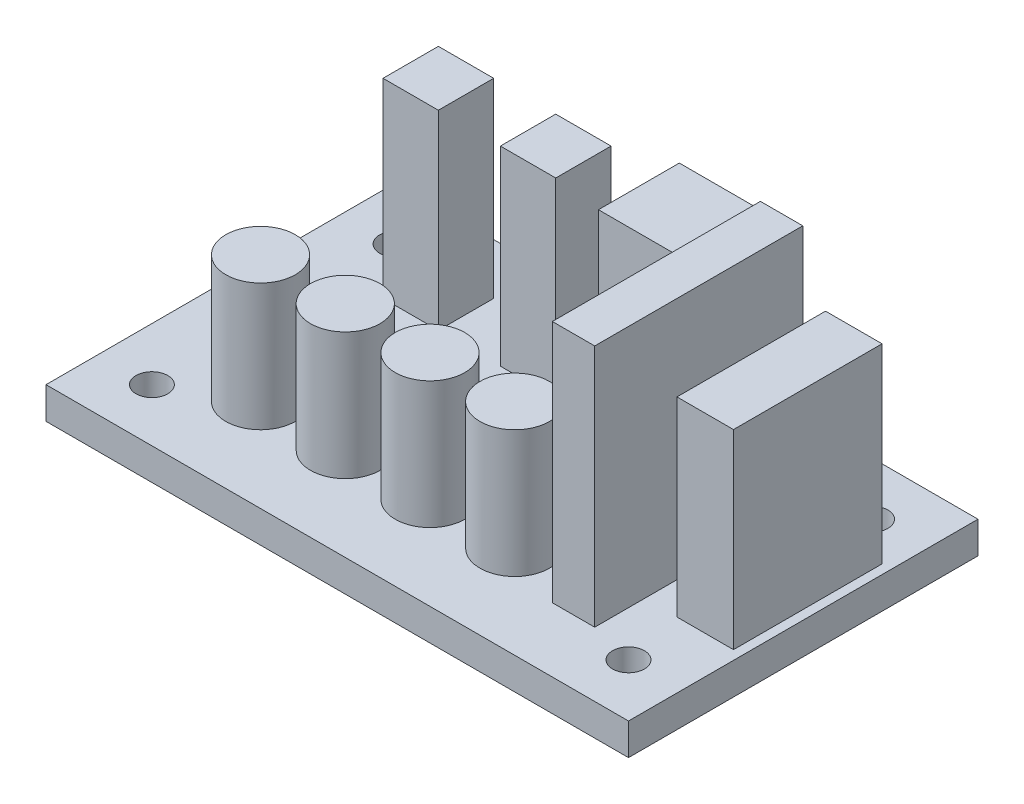
ISO-10303-21;
HEADER;
FILE_DESCRIPTION(('STEP AP214'),'2;1');
FILE_NAME('part.step','',(''),(''),'','','');
FILE_SCHEMA(('AUTOMOTIVE_DESIGN { 1 0 10303 214 1 1 1 1 }'));
ENDSEC;
DATA;
#1=APPLICATION_CONTEXT('core data for automotive mechanical design processes');
#2=APPLICATION_PROTOCOL_DEFINITION('international standard','automotive_design',2000,#1);
#3=PRODUCT_CONTEXT('',#1,'mechanical');
#4=PRODUCT('Part','Part','',(#3));
#5=PRODUCT_RELATED_PRODUCT_CATEGORY('part','',(#4));
#6=PRODUCT_DEFINITION_FORMATION('','',#4);
#7=PRODUCT_DEFINITION_CONTEXT('part definition',#1,'design');
#8=PRODUCT_DEFINITION('design','',#6,#7);
#9=PRODUCT_DEFINITION_SHAPE('','',#8);
#10=(LENGTH_UNIT() NAMED_UNIT(*) SI_UNIT(.MILLI.,.METRE.));
#11=(NAMED_UNIT(*) PLANE_ANGLE_UNIT() SI_UNIT($,.RADIAN.));
#12=(NAMED_UNIT(*) SI_UNIT($,.STERADIAN.) SOLID_ANGLE_UNIT());
#13=UNCERTAINTY_MEASURE_WITH_UNIT(LENGTH_MEASURE(1.E-05),#10,'distance_accuracy_value','');
#14=(GEOMETRIC_REPRESENTATION_CONTEXT(3) GLOBAL_UNCERTAINTY_ASSIGNED_CONTEXT((#13)) GLOBAL_UNIT_ASSIGNED_CONTEXT((#10,
#11,#12)) REPRESENTATION_CONTEXT('',''));
#15=CARTESIAN_POINT('',(0.,0.,0.));
#16=DIRECTION('',(0.,0.,1.));
#17=DIRECTION('',(1.,0.,0.));
#18=AXIS2_PLACEMENT_3D('',#15,#16,#17);
#19=CARTESIAN_POINT('',(0.,3.,-33.));
#20=DIRECTION('',(0.,-1.,0.));
#21=DIRECTION('',(0.,0.,-1.));
#22=AXIS2_PLACEMENT_3D('',#19,#20,#21);
#23=PLANE('',#22);
#24=CARTESIAN_POINT('',(35.5,3.,-8.75676326373309));
#25=DIRECTION('',(0.,-1.,0.));
#26=DIRECTION('',(0.,0.,-1.));
#27=AXIS2_PLACEMENT_3D('',#24,#25,#26);
#28=CIRCLE('',#27,3.27908034810426);
#29=CARTESIAN_POINT('',(35.5,3.,-12.0358436118374));
#30=VERTEX_POINT('',#29);
#31=EDGE_CURVE('E11',#30,#30,#28,.F.);
#32=ORIENTED_EDGE('',*,*,#31,.F.);
#33=EDGE_LOOP('',(#32));
#34=FACE_BOUND('',#33,.T.);
#35=CARTESIAN_POINT('',(19.5,3.,-8.75676326373309));
#36=DIRECTION('',(0.,-1.,0.));
#37=DIRECTION('',(0.,0.,-1.));
#38=AXIS2_PLACEMENT_3D('',#35,#36,#37);
#39=CIRCLE('',#38,3.27908034810427);
#40=CARTESIAN_POINT('',(19.5,3.,-12.0358436118374));
#41=VERTEX_POINT('',#40);
#42=EDGE_CURVE('E422',#41,#41,#39,.F.);
#43=ORIENTED_EDGE('',*,*,#42,.F.);
#44=EDGE_LOOP('',(#43));
#45=FACE_BOUND('',#44,.T.);
#46=DIRECTION('',(0.,0.,1.));
#47=VECTOR('',#46,1.);
#48=CARTESIAN_POINT('',(19.9399820026374,3.,-28.1893330684113));
#49=LINE('',#48,#47);
#50=CARTESIAN_POINT('',(19.9399820026374,3.,-28.1893330684113));
#51=VERTEX_POINT('',#50);
#52=CARTESIAN_POINT('',(19.9399820026374,3.,-22.96497794012));
#53=VERTEX_POINT('',#52);
#54=EDGE_CURVE('E232',#51,#53,#49,.T.);
#55=ORIENTED_EDGE('',*,*,#54,.F.);
#56=DIRECTION('',(-1.,0.,0.));
#57=VECTOR('',#56,1.);
#58=CARTESIAN_POINT('',(19.9399820026374,3.,-28.1893330684113));
#59=LINE('',#58,#57);
#60=CARTESIAN_POINT('',(25.1643371309287,3.,-28.1893330684113));
#61=VERTEX_POINT('',#60);
#62=EDGE_CURVE('E237',#61,#51,#59,.T.);
#63=ORIENTED_EDGE('',*,*,#62,.F.);
#64=DIRECTION('',(0.,0.,-1.));
#65=VECTOR('',#64,1.);
#66=CARTESIAN_POINT('',(25.1643371309287,3.,-28.1893330684113));
#67=LINE('',#66,#65);
#68=CARTESIAN_POINT('',(25.1643371309287,3.,-22.96497794012));
#69=VERTEX_POINT('',#68);
#70=EDGE_CURVE('E249',#69,#61,#67,.T.);
#71=ORIENTED_EDGE('',*,*,#70,.F.);
#72=DIRECTION('',(1.,0.,0.));
#73=VECTOR('',#72,1.);
#74=CARTESIAN_POINT('',(19.9399820026374,3.,-22.96497794012));
#75=LINE('',#74,#73);
#76=EDGE_CURVE('E246',#53,#69,#75,.T.);
#77=ORIENTED_EDGE('',*,*,#76,.F.);
#78=EDGE_LOOP('',(#55,#63,#71,#77));
#79=FACE_BOUND('',#78,.T.);
#80=DIRECTION('',(0.,0.,1.));
#81=VECTOR('',#80,1.);
#82=CARTESIAN_POINT('',(48.7885103903238,3.,-24.8147061126076));
#83=LINE('',#82,#81);
#84=CARTESIAN_POINT('',(48.7885103903238,3.,-24.8147061126076));
#85=VERTEX_POINT('',#84);
#86=CARTESIAN_POINT('',(48.7885103903238,3.,-10.7874044385108));
#87=VERTEX_POINT('',#86);
#88=EDGE_CURVE('E298',#85,#87,#83,.T.);
#89=ORIENTED_EDGE('',*,*,#88,.F.);
#90=DIRECTION('',(-1.,0.,0.));
#91=VECTOR('',#90,1.);
#92=CARTESIAN_POINT('',(48.7885103903238,3.,-24.8147061126076));
#93=LINE('',#92,#91);
#94=CARTESIAN_POINT('',(54.1262633456281,3.,-24.8147061126076));
#95=VERTEX_POINT('',#94);
#96=EDGE_CURVE('E303',#95,#85,#93,.T.);
#97=ORIENTED_EDGE('',*,*,#96,.F.);
#98=DIRECTION('',(0.,0.,-1.));
#99=VECTOR('',#98,1.);
#100=CARTESIAN_POINT('',(54.1262633456281,3.,-24.8147061126076));
#101=LINE('',#100,#99);
#102=CARTESIAN_POINT('',(54.1262633456281,3.,-10.7874044385108));
#103=VERTEX_POINT('',#102);
#104=EDGE_CURVE('E315',#103,#95,#101,.T.);
#105=ORIENTED_EDGE('',*,*,#104,.F.);
#106=DIRECTION('',(1.,0.,0.));
#107=VECTOR('',#106,1.);
#108=CARTESIAN_POINT('',(48.7885103903238,3.,-10.7874044385108));
#109=LINE('',#108,#107);
#110=EDGE_CURVE('E312',#87,#103,#109,.T.);
#111=ORIENTED_EDGE('',*,*,#110,.F.);
#112=EDGE_LOOP('',(#89,#97,#105,#111));
#113=FACE_BOUND('',#112,.T.);
#114=CARTESIAN_POINT('',(5.,3.,-5.));
#115=DIRECTION('',(0.,1.,0.));
#116=DIRECTION('',(0.,0.,-1.));
#117=AXIS2_PLACEMENT_3D('',#114,#115,#116);
#118=CIRCLE('',#117,1.5);
#119=CARTESIAN_POINT('',(5.,3.,-6.5));
#120=VERTEX_POINT('',#119);
#121=EDGE_CURVE('E366',#120,#120,#118,.T.);
#122=ORIENTED_EDGE('',*,*,#121,.F.);
#123=EDGE_LOOP('',(#122));
#124=FACE_BOUND('',#123,.T.);
#125=CARTESIAN_POINT('',(50.,3.,-28.));
#126=DIRECTION('',(0.,1.,0.));
#127=DIRECTION('',(0.,0.,-1.));
#128=AXIS2_PLACEMENT_3D('',#125,#126,#127);
#129=CIRCLE('',#128,1.5);
#130=CARTESIAN_POINT('',(50.,3.,-29.5));
#131=VERTEX_POINT('',#130);
#132=EDGE_CURVE('E378',#131,#131,#129,.T.);
#133=ORIENTED_EDGE('',*,*,#132,.F.);
#134=EDGE_LOOP('',(#133));
#135=FACE_BOUND('',#134,.T.);
#136=DIRECTION('',(0.,0.,1.));
#137=VECTOR('',#136,1.);
#138=CARTESIAN_POINT('',(0.,3.,0.));
#139=LINE('',#138,#137);
#140=CARTESIAN_POINT('',(0.,3.,-33.));
#141=VERTEX_POINT('',#140);
#142=CARTESIAN_POINT('',(0.,3.,0.));
#143=VERTEX_POINT('',#142);
#144=EDGE_CURVE('E390',#141,#143,#139,.T.);
#145=ORIENTED_EDGE('',*,*,#144,.T.);
#146=DIRECTION('',(1.,0.,0.));
#147=VECTOR('',#146,1.);
#148=CARTESIAN_POINT('',(0.,3.,0.));
#149=LINE('',#148,#147);
#150=CARTESIAN_POINT('',(55.,3.,0.));
#151=VERTEX_POINT('',#150);
#152=EDGE_CURVE('E393',#143,#151,#149,.T.);
#153=ORIENTED_EDGE('',*,*,#152,.T.);
#154=DIRECTION('',(0.,0.,-1.));
#155=VECTOR('',#154,1.);
#156=CARTESIAN_POINT('',(55.,3.,0.));
#157=LINE('',#156,#155);
#158=CARTESIAN_POINT('',(55.,3.,-33.));
#159=VERTEX_POINT('',#158);
#160=EDGE_CURVE('E396',#151,#159,#157,.T.);
#161=ORIENTED_EDGE('',*,*,#160,.T.);
#162=DIRECTION('',(-1.,0.,0.));
#163=VECTOR('',#162,1.);
#164=CARTESIAN_POINT('',(0.,3.,-33.));
#165=LINE('',#164,#163);
#166=EDGE_CURVE('E398',#159,#141,#165,.T.);
#167=ORIENTED_EDGE('',*,*,#166,.T.);
#168=EDGE_LOOP('',(#145,#153,#161,#167));
#169=FACE_BOUND('',#168,.T.);
#170=CARTESIAN_POINT('',(5.,3.,-28.));
#171=DIRECTION('',(0.,1.,0.));
#172=DIRECTION('',(0.,0.,1.));
#173=AXIS2_PLACEMENT_3D('',#170,#171,#172);
#174=CIRCLE('',#173,1.5);
#175=CARTESIAN_POINT('',(5.,3.,-26.5));
#176=VERTEX_POINT('',#175);
#177=EDGE_CURVE('E384',#176,#176,#174,.T.);
#178=ORIENTED_EDGE('',*,*,#177,.F.);
#179=EDGE_LOOP('',(#178));
#180=FACE_BOUND('',#179,.T.);
#181=CARTESIAN_POINT('',(50.,3.,-5.));
#182=DIRECTION('',(0.,1.,0.));
#183=DIRECTION('',(0.,0.,1.));
#184=AXIS2_PLACEMENT_3D('',#181,#182,#183);
#185=CIRCLE('',#184,1.5);
#186=CARTESIAN_POINT('',(50.,3.,-3.5));
#187=VERTEX_POINT('',#186);
#188=EDGE_CURVE('E372',#187,#187,#185,.T.);
#189=ORIENTED_EDGE('',*,*,#188,.F.);
#190=EDGE_LOOP('',(#189));
#191=FACE_BOUND('',#190,.T.);
#192=DIRECTION('',(0.,0.,1.));
#193=VECTOR('',#192,1.);
#194=CARTESIAN_POINT('',(29.7763452337447,3.,-30.0227773688517));
#195=LINE('',#194,#193);
#196=CARTESIAN_POINT('',(29.7763452337447,3.,-30.0227773688517));
#197=VERTEX_POINT('',#196);
#198=CARTESIAN_POINT('',(29.7763452337447,3.,-22.3885755891189));
#199=VERTEX_POINT('',#198);
#200=EDGE_CURVE('E332',#197,#199,#195,.T.);
#201=ORIENTED_EDGE('',*,*,#200,.F.);
#202=DIRECTION('',(-1.,0.,0.));
#203=VECTOR('',#202,1.);
#204=CARTESIAN_POINT('',(29.7763452337447,3.,-30.0227773688517));
#205=LINE('',#204,#203);
#206=CARTESIAN_POINT('',(37.4105470134776,3.,-30.0227773688517));
#207=VERTEX_POINT('',#206);
#208=EDGE_CURVE('E337',#207,#197,#205,.T.);
#209=ORIENTED_EDGE('',*,*,#208,.F.);
#210=DIRECTION('',(0.,0.,-1.));
#211=VECTOR('',#210,1.);
#212=CARTESIAN_POINT('',(37.4105470134776,3.,-30.0227773688517));
#213=LINE('',#212,#211);
#214=CARTESIAN_POINT('',(37.4105470134776,3.,-22.3885755891189));
#215=VERTEX_POINT('',#214);
#216=EDGE_CURVE('E349',#215,#207,#213,.T.);
#217=ORIENTED_EDGE('',*,*,#216,.F.);
#218=DIRECTION('',(1.,0.,0.));
#219=VECTOR('',#218,1.);
#220=CARTESIAN_POINT('',(29.7763452337447,3.,-22.3885755891189));
#221=LINE('',#220,#219);
#222=EDGE_CURVE('E346',#199,#215,#221,.T.);
#223=ORIENTED_EDGE('',*,*,#222,.F.);
#224=EDGE_LOOP('',(#201,#209,#217,#223));
#225=FACE_BOUND('',#224,.T.);
#226=DIRECTION('',(0.,0.,1.));
#227=VECTOR('',#226,1.);
#228=CARTESIAN_POINT('',(8.85721479602886,3.,-28.1893330684113));
#229=LINE('',#228,#227);
#230=CARTESIAN_POINT('',(8.85721479602886,3.,-28.1893330684113));
#231=VERTEX_POINT('',#230);
#232=CARTESIAN_POINT('',(8.85721479602886,3.,-22.96497794012));
#233=VERTEX_POINT('',#232);
#234=EDGE_CURVE('E265',#231,#233,#229,.T.);
#235=ORIENTED_EDGE('',*,*,#234,.F.);
#236=DIRECTION('',(-1.,0.,0.));
#237=VECTOR('',#236,1.);
#238=CARTESIAN_POINT('',(8.85721479602886,3.,-28.1893330684113));
#239=LINE('',#238,#237);
#240=CARTESIAN_POINT('',(14.0815699243202,3.,-28.1893330684113));
#241=VERTEX_POINT('',#240);
#242=EDGE_CURVE('E270',#241,#231,#239,.T.);
#243=ORIENTED_EDGE('',*,*,#242,.F.);
#244=DIRECTION('',(0.,0.,-1.));
#245=VECTOR('',#244,1.);
#246=CARTESIAN_POINT('',(14.0815699243202,3.,-28.1893330684113));
#247=LINE('',#246,#245);
#248=CARTESIAN_POINT('',(14.0815699243202,3.,-22.96497794012));
#249=VERTEX_POINT('',#248);
#250=EDGE_CURVE('E282',#249,#241,#247,.T.);
#251=ORIENTED_EDGE('',*,*,#250,.F.);
#252=DIRECTION('',(1.,0.,0.));
#253=VECTOR('',#252,1.);
#254=CARTESIAN_POINT('',(8.85721479602886,3.,-22.96497794012));
#255=LINE('',#254,#253);
#256=EDGE_CURVE('E279',#233,#249,#255,.T.);
#257=ORIENTED_EDGE('',*,*,#256,.F.);
#258=EDGE_LOOP('',(#235,#243,#251,#257));
#259=FACE_BOUND('',#258,.T.);
#260=CARTESIAN_POINT('',(11.5,3.,-8.75676326373309));
#261=DIRECTION('',(0.,-1.,0.));
#262=DIRECTION('',(0.,0.,-1.));
#263=AXIS2_PLACEMENT_3D('',#260,#261,#262);
#264=CIRCLE('',#263,3.27908034810427);
#265=CARTESIAN_POINT('',(11.5,3.,-12.0358436118374));
#266=VERTEX_POINT('',#265);
#267=EDGE_CURVE('E419',#266,#266,#264,.F.);
#268=ORIENTED_EDGE('',*,*,#267,.F.);
#269=EDGE_LOOP('',(#268));
#270=FACE_BOUND('',#269,.T.);
#271=CARTESIAN_POINT('',(27.5,3.,-8.75676326373309));
#272=DIRECTION('',(0.,-1.,0.));
#273=DIRECTION('',(0.,0.,-1.));
#274=AXIS2_PLACEMENT_3D('',#271,#272,#273);
#275=CIRCLE('',#274,3.27908034810427);
#276=CARTESIAN_POINT('',(27.5,3.,-12.0358436118374));
#277=VERTEX_POINT('',#276);
#278=EDGE_CURVE('E41',#277,#277,#275,.F.);
#279=ORIENTED_EDGE('',*,*,#278,.F.);
#280=EDGE_LOOP('',(#279));
#281=FACE_BOUND('',#280,.T.);
#282=DIRECTION('',(0.,0.,1.));
#283=VECTOR('',#282,1.);
#284=CARTESIAN_POINT('',(41.7374555393621,3.,-25.7183290557066));
#285=LINE('',#284,#283);
#286=CARTESIAN_POINT('',(41.7374555393621,3.,-25.7183290557066));
#287=VERTEX_POINT('',#286);
#288=CARTESIAN_POINT('',(41.7374555393621,3.,-6.07222956749354));
#289=VERTEX_POINT('',#288);
#290=EDGE_CURVE('E214',#287,#289,#285,.T.);
#291=ORIENTED_EDGE('',*,*,#290,.F.);
#292=DIRECTION('',(-1.,0.,0.));
#293=VECTOR('',#292,1.);
#294=CARTESIAN_POINT('',(41.7374555393621,3.,-25.7183290557066));
#295=LINE('',#294,#293);
#296=CARTESIAN_POINT('',(45.7374555393621,3.,-25.7183290557066));
#297=VERTEX_POINT('',#296);
#298=EDGE_CURVE('E211',#297,#287,#295,.T.);
#299=ORIENTED_EDGE('',*,*,#298,.F.);
#300=DIRECTION('',(0.,0.,-1.));
#301=VECTOR('',#300,1.);
#302=CARTESIAN_POINT('',(45.7374555393621,3.,-25.7183290557066));
#303=LINE('',#302,#301);
#304=CARTESIAN_POINT('',(45.7374555393621,3.,-6.07222956749354));
#305=VERTEX_POINT('',#304);
#306=EDGE_CURVE('E53',#305,#297,#303,.T.);
#307=ORIENTED_EDGE('',*,*,#306,.F.);
#308=DIRECTION('',(1.,0.,0.));
#309=VECTOR('',#308,1.);
#310=CARTESIAN_POINT('',(41.7374555393621,3.,-6.07222956749354));
#311=LINE('',#310,#309);
#312=EDGE_CURVE('E48',#289,#305,#311,.T.);
#313=ORIENTED_EDGE('',*,*,#312,.F.);
#314=EDGE_LOOP('',(#291,#299,#307,#313));
#315=FACE_BOUND('',#314,.T.);
#316=ADVANCED_FACE('F33',(#34,#45,#79,#113,#124,#135,#169,#180,#191,#225,#259,#270,#281,#315),
#23,.F.);
#317=CARTESIAN_POINT('',(0.,0.,-33.));
#318=DIRECTION('',(0.,-1.,0.));
#319=DIRECTION('',(0.,0.,-1.));
#320=AXIS2_PLACEMENT_3D('',#317,#318,#319);
#321=PLANE('',#320);
#322=CARTESIAN_POINT('',(50.,0.,-5.));
#323=DIRECTION('',(0.,1.,0.));
#324=DIRECTION('',(0.,0.,1.));
#325=AXIS2_PLACEMENT_3D('',#322,#323,#324);
#326=CIRCLE('',#325,1.5);
#327=CARTESIAN_POINT('',(50.,0.,-3.5));
#328=VERTEX_POINT('',#327);
#329=EDGE_CURVE('E369',#328,#328,#326,.T.);
#330=ORIENTED_EDGE('',*,*,#329,.T.);
#331=EDGE_LOOP('',(#330));
#332=FACE_BOUND('',#331,.T.);
#333=CARTESIAN_POINT('',(5.,0.,-28.));
#334=DIRECTION('',(0.,1.,0.));
#335=DIRECTION('',(0.,0.,1.));
#336=AXIS2_PLACEMENT_3D('',#333,#334,#335);
#337=CIRCLE('',#336,1.5);
#338=CARTESIAN_POINT('',(5.,0.,-26.5));
#339=VERTEX_POINT('',#338);
#340=EDGE_CURVE('E381',#339,#339,#337,.T.);
#341=ORIENTED_EDGE('',*,*,#340,.T.);
#342=EDGE_LOOP('',(#341));
#343=FACE_BOUND('',#342,.T.);
#344=DIRECTION('',(0.,0.,1.));
#345=VECTOR('',#344,1.);
#346=CARTESIAN_POINT('',(0.,0.,0.));
#347=LINE('',#346,#345);
#348=CARTESIAN_POINT('',(0.,0.,-33.));
#349=VERTEX_POINT('',#348);
#350=CARTESIAN_POINT('',(0.,0.,0.));
#351=VERTEX_POINT('',#350);
#352=EDGE_CURVE('E387',#349,#351,#347,.T.);
#353=ORIENTED_EDGE('',*,*,#352,.F.);
#354=DIRECTION('',(-1.,0.,0.));
#355=VECTOR('',#354,1.);
#356=CARTESIAN_POINT('',(0.,0.,-33.));
#357=LINE('',#356,#355);
#358=CARTESIAN_POINT('',(55.,0.,-33.));
#359=VERTEX_POINT('',#358);
#360=EDGE_CURVE('E394',#359,#349,#357,.T.);
#361=ORIENTED_EDGE('',*,*,#360,.F.);
#362=DIRECTION('',(0.,0.,-1.));
#363=VECTOR('',#362,1.);
#364=CARTESIAN_POINT('',(55.,0.,0.));
#365=LINE('',#364,#363);
#366=CARTESIAN_POINT('',(55.,0.,0.));
#367=VERTEX_POINT('',#366);
#368=EDGE_CURVE('E405',#367,#359,#365,.T.);
#369=ORIENTED_EDGE('',*,*,#368,.F.);
#370=DIRECTION('',(1.,0.,0.));
#371=VECTOR('',#370,1.);
#372=CARTESIAN_POINT('',(0.,0.,0.));
#373=LINE('',#372,#371);
#374=EDGE_CURVE('E403',#351,#367,#373,.T.);
#375=ORIENTED_EDGE('',*,*,#374,.F.);
#376=EDGE_LOOP('',(#353,#361,#369,#375));
#377=FACE_BOUND('',#376,.T.);
#378=CARTESIAN_POINT('',(50.,0.,-28.));
#379=DIRECTION('',(0.,1.,0.));
#380=DIRECTION('',(0.,0.,-1.));
#381=AXIS2_PLACEMENT_3D('',#378,#379,#380);
#382=CIRCLE('',#381,1.5);
#383=CARTESIAN_POINT('',(50.,0.,-29.5));
#384=VERTEX_POINT('',#383);
#385=EDGE_CURVE('E375',#384,#384,#382,.T.);
#386=ORIENTED_EDGE('',*,*,#385,.T.);
#387=EDGE_LOOP('',(#386));
#388=FACE_BOUND('',#387,.T.);
#389=CARTESIAN_POINT('',(5.,0.,-5.));
#390=DIRECTION('',(0.,1.,0.));
#391=DIRECTION('',(0.,0.,-1.));
#392=AXIS2_PLACEMENT_3D('',#389,#390,#391);
#393=CIRCLE('',#392,1.5);
#394=CARTESIAN_POINT('',(5.,0.,-6.5));
#395=VERTEX_POINT('',#394);
#396=EDGE_CURVE('E365',#395,#395,#393,.T.);
#397=ORIENTED_EDGE('',*,*,#396,.T.);
#398=EDGE_LOOP('',(#397));
#399=FACE_BOUND('',#398,.T.);
#400=ADVANCED_FACE('F430',(#332,#343,#377,#388,#399),#321,.T.);
#401=CARTESIAN_POINT('',(0.,3.,0.));
#402=DIRECTION('',(1.,0.,0.));
#403=DIRECTION('',(0.,0.,-1.));
#404=AXIS2_PLACEMENT_3D('',#401,#402,#403);
#405=PLANE('',#404);
#406=ORIENTED_EDGE('',*,*,#352,.T.);
#407=DIRECTION('',(0.,-1.,0.));
#408=VECTOR('',#407,1.);
#409=CARTESIAN_POINT('',(0.,3.,0.));
#410=LINE('',#409,#408);
#411=EDGE_CURVE('E416',#143,#351,#410,.T.);
#412=ORIENTED_EDGE('',*,*,#411,.F.);
#413=ORIENTED_EDGE('',*,*,#144,.F.);
#414=DIRECTION('',(0.,-1.,0.));
#415=VECTOR('',#414,1.);
#416=CARTESIAN_POINT('',(0.,3.,-33.));
#417=LINE('',#416,#415);
#418=EDGE_CURVE('E400',#141,#349,#417,.T.);
#419=ORIENTED_EDGE('',*,*,#418,.T.);
#420=EDGE_LOOP('',(#406,#412,#413,#419));
#421=FACE_BOUND('',#420,.T.);
#422=ADVANCED_FACE('F35',(#421),#405,.F.);
#423=CARTESIAN_POINT('',(0.,3.,0.));
#424=DIRECTION('',(0.,0.,-1.));
#425=DIRECTION('',(-1.,0.,0.));
#426=AXIS2_PLACEMENT_3D('',#423,#424,#425);
#427=PLANE('',#426);
#428=ORIENTED_EDGE('',*,*,#374,.T.);
#429=DIRECTION('',(0.,-1.,0.));
#430=VECTOR('',#429,1.);
#431=CARTESIAN_POINT('',(55.,3.,0.));
#432=LINE('',#431,#430);
#433=EDGE_CURVE('E413',#151,#367,#432,.T.);
#434=ORIENTED_EDGE('',*,*,#433,.F.);
#435=ORIENTED_EDGE('',*,*,#152,.F.);
#436=ORIENTED_EDGE('',*,*,#411,.T.);
#437=EDGE_LOOP('',(#428,#434,#435,#436));
#438=FACE_BOUND('',#437,.T.);
#439=ADVANCED_FACE('F596',(#438),#427,.F.);
#440=CARTESIAN_POINT('',(55.,3.,0.));
#441=DIRECTION('',(-1.,0.,0.));
#442=DIRECTION('',(0.,0.,1.));
#443=AXIS2_PLACEMENT_3D('',#440,#441,#442);
#444=PLANE('',#443);
#445=ORIENTED_EDGE('',*,*,#368,.T.);
#446=DIRECTION('',(0.,-1.,0.));
#447=VECTOR('',#446,1.);
#448=CARTESIAN_POINT('',(55.,3.,-33.));
#449=LINE('',#448,#447);
#450=EDGE_CURVE('E410',#159,#359,#449,.T.);
#451=ORIENTED_EDGE('',*,*,#450,.F.);
#452=ORIENTED_EDGE('',*,*,#160,.F.);
#453=ORIENTED_EDGE('',*,*,#433,.T.);
#454=EDGE_LOOP('',(#445,#451,#452,#453));
#455=FACE_BOUND('',#454,.T.);
#456=ADVANCED_FACE('F593',(#455),#444,.F.);
#457=CARTESIAN_POINT('',(0.,3.,-33.));
#458=DIRECTION('',(0.,0.,1.));
#459=DIRECTION('',(1.,0.,0.));
#460=AXIS2_PLACEMENT_3D('',#457,#458,#459);
#461=PLANE('',#460);
#462=ORIENTED_EDGE('',*,*,#360,.T.);
#463=ORIENTED_EDGE('',*,*,#418,.F.);
#464=ORIENTED_EDGE('',*,*,#166,.F.);
#465=ORIENTED_EDGE('',*,*,#450,.T.);
#466=EDGE_LOOP('',(#462,#463,#464,#465));
#467=FACE_BOUND('',#466,.T.);
#468=ADVANCED_FACE('F585',(#467),#461,.F.);
#469=CARTESIAN_POINT('',(5.,3.,-28.));
#470=DIRECTION('',(0.,-1.,0.));
#471=DIRECTION('',(0.,0.,-1.));
#472=AXIS2_PLACEMENT_3D('',#469,#470,#471);
#473=CYLINDRICAL_SURFACE('',#472,1.5);
#474=ORIENTED_EDGE('',*,*,#177,.T.);
#475=EDGE_LOOP('',(#474));
#476=FACE_BOUND('',#475,.T.);
#477=ORIENTED_EDGE('',*,*,#340,.F.);
#478=EDGE_LOOP('',(#477));
#479=FACE_BOUND('',#478,.T.);
#480=ADVANCED_FACE('F582',(#476,#479),#473,.F.);
#481=CARTESIAN_POINT('',(50.,3.,-28.));
#482=DIRECTION('',(0.,-1.,0.));
#483=DIRECTION('',(0.,0.,-1.));
#484=AXIS2_PLACEMENT_3D('',#481,#482,#483);
#485=CYLINDRICAL_SURFACE('',#484,1.5);
#486=ORIENTED_EDGE('',*,*,#132,.T.);
#487=EDGE_LOOP('',(#486));
#488=FACE_BOUND('',#487,.T.);
#489=ORIENTED_EDGE('',*,*,#385,.F.);
#490=EDGE_LOOP('',(#489));
#491=FACE_BOUND('',#490,.T.);
#492=ADVANCED_FACE('F578',(#488,#491),#485,.F.);
#493=CARTESIAN_POINT('',(50.,3.,-5.));
#494=DIRECTION('',(0.,-1.,0.));
#495=DIRECTION('',(0.,0.,-1.));
#496=AXIS2_PLACEMENT_3D('',#493,#494,#495);
#497=CYLINDRICAL_SURFACE('',#496,1.5);
#498=ORIENTED_EDGE('',*,*,#188,.T.);
#499=EDGE_LOOP('',(#498));
#500=FACE_BOUND('',#499,.T.);
#501=ORIENTED_EDGE('',*,*,#329,.F.);
#502=EDGE_LOOP('',(#501));
#503=FACE_BOUND('',#502,.T.);
#504=ADVANCED_FACE('F574',(#500,#503),#497,.F.);
#505=CARTESIAN_POINT('',(5.,3.,-5.));
#506=DIRECTION('',(0.,-1.,0.));
#507=DIRECTION('',(0.,0.,-1.));
#508=AXIS2_PLACEMENT_3D('',#505,#506,#507);
#509=CYLINDRICAL_SURFACE('',#508,1.5);
#510=ORIENTED_EDGE('',*,*,#121,.T.);
#511=EDGE_LOOP('',(#510));
#512=FACE_BOUND('',#511,.T.);
#513=ORIENTED_EDGE('',*,*,#396,.F.);
#514=EDGE_LOOP('',(#513));
#515=FACE_BOUND('',#514,.T.);
#516=ADVANCED_FACE('F570',(#512,#515),#509,.F.);
#517=CARTESIAN_POINT('',(29.7763452337447,21.,-30.0227773688517));
#518=DIRECTION('',(1.,0.,0.));
#519=DIRECTION('',(0.,0.,-1.));
#520=AXIS2_PLACEMENT_3D('',#517,#518,#519);
#521=PLANE('',#520);
#522=ORIENTED_EDGE('',*,*,#200,.T.);
#523=DIRECTION('',(0.,-1.,0.));
#524=VECTOR('',#523,1.);
#525=CARTESIAN_POINT('',(29.7763452337447,21.,-22.3885755891189));
#526=LINE('',#525,#524);
#527=CARTESIAN_POINT('',(29.7763452337447,21.,-22.3885755891189));
#528=VERTEX_POINT('',#527);
#529=EDGE_CURVE('E362',#528,#199,#526,.T.);
#530=ORIENTED_EDGE('',*,*,#529,.F.);
#531=DIRECTION('',(0.,0.,1.));
#532=VECTOR('',#531,1.);
#533=CARTESIAN_POINT('',(29.7763452337447,21.,-30.0227773688517));
#534=LINE('',#533,#532);
#535=CARTESIAN_POINT('',(29.7763452337447,21.,-30.0227773688517));
#536=VERTEX_POINT('',#535);
#537=EDGE_CURVE('E333',#536,#528,#534,.T.);
#538=ORIENTED_EDGE('',*,*,#537,.F.);
#539=DIRECTION('',(0.,-1.,0.));
#540=VECTOR('',#539,1.);
#541=CARTESIAN_POINT('',(29.7763452337447,21.,-30.0227773688517));
#542=LINE('',#541,#540);
#543=EDGE_CURVE('E343',#536,#197,#542,.T.);
#544=ORIENTED_EDGE('',*,*,#543,.T.);
#545=EDGE_LOOP('',(#522,#530,#538,#544));
#546=FACE_BOUND('',#545,.T.);
#547=ADVANCED_FACE('F566',(#546),#521,.F.);
#548=CARTESIAN_POINT('',(29.7763452337447,21.,-22.3885755891189));
#549=DIRECTION('',(0.,0.,-1.));
#550=DIRECTION('',(-1.,0.,0.));
#551=AXIS2_PLACEMENT_3D('',#548,#549,#550);
#552=PLANE('',#551);
#553=ORIENTED_EDGE('',*,*,#222,.T.);
#554=DIRECTION('',(0.,-1.,0.));
#555=VECTOR('',#554,1.);
#556=CARTESIAN_POINT('',(37.4105470134776,21.,-22.3885755891189));
#557=LINE('',#556,#555);
#558=CARTESIAN_POINT('',(37.4105470134776,21.,-22.3885755891189));
#559=VERTEX_POINT('',#558);
#560=EDGE_CURVE('E359',#559,#215,#557,.T.);
#561=ORIENTED_EDGE('',*,*,#560,.F.);
#562=DIRECTION('',(1.,0.,0.));
#563=VECTOR('',#562,1.);
#564=CARTESIAN_POINT('',(29.7763452337447,21.,-22.3885755891189));
#565=LINE('',#564,#563);
#566=EDGE_CURVE('E336',#528,#559,#565,.T.);
#567=ORIENTED_EDGE('',*,*,#566,.F.);
#568=ORIENTED_EDGE('',*,*,#529,.T.);
#569=EDGE_LOOP('',(#553,#561,#567,#568));
#570=FACE_BOUND('',#569,.T.);
#571=ADVANCED_FACE('F562',(#570),#552,.F.);
#572=CARTESIAN_POINT('',(37.4105470134776,21.,-30.0227773688517));
#573=DIRECTION('',(-1.,0.,0.));
#574=DIRECTION('',(0.,0.,1.));
#575=AXIS2_PLACEMENT_3D('',#572,#573,#574);
#576=PLANE('',#575);
#577=ORIENTED_EDGE('',*,*,#216,.T.);
#578=DIRECTION('',(0.,-1.,0.));
#579=VECTOR('',#578,1.);
#580=CARTESIAN_POINT('',(37.4105470134776,21.,-30.0227773688517));
#581=LINE('',#580,#579);
#582=CARTESIAN_POINT('',(37.4105470134776,21.,-30.0227773688517));
#583=VERTEX_POINT('',#582);
#584=EDGE_CURVE('E356',#583,#207,#581,.T.);
#585=ORIENTED_EDGE('',*,*,#584,.F.);
#586=DIRECTION('',(0.,0.,-1.));
#587=VECTOR('',#586,1.);
#588=CARTESIAN_POINT('',(37.4105470134776,21.,-30.0227773688517));
#589=LINE('',#588,#587);
#590=EDGE_CURVE('E339',#559,#583,#589,.T.);
#591=ORIENTED_EDGE('',*,*,#590,.F.);
#592=ORIENTED_EDGE('',*,*,#560,.T.);
#593=EDGE_LOOP('',(#577,#585,#591,#592));
#594=FACE_BOUND('',#593,.T.);
#595=ADVANCED_FACE('F558',(#594),#576,.F.);
#596=CARTESIAN_POINT('',(29.7763452337447,21.,-30.0227773688517));
#597=DIRECTION('',(0.,0.,1.));
#598=DIRECTION('',(1.,0.,0.));
#599=AXIS2_PLACEMENT_3D('',#596,#597,#598);
#600=PLANE('',#599);
#601=ORIENTED_EDGE('',*,*,#208,.T.);
#602=ORIENTED_EDGE('',*,*,#543,.F.);
#603=DIRECTION('',(-1.,0.,0.));
#604=VECTOR('',#603,1.);
#605=CARTESIAN_POINT('',(29.7763452337447,21.,-30.0227773688517));
#606=LINE('',#605,#604);
#607=EDGE_CURVE('E341',#583,#536,#606,.T.);
#608=ORIENTED_EDGE('',*,*,#607,.F.);
#609=ORIENTED_EDGE('',*,*,#584,.T.);
#610=EDGE_LOOP('',(#601,#602,#608,#609));
#611=FACE_BOUND('',#610,.T.);
#612=ADVANCED_FACE('F554',(#611),#600,.F.);
#613=CARTESIAN_POINT('',(29.7763452337447,21.,-22.3885755891189));
#614=DIRECTION('',(0.,1.,0.));
#615=DIRECTION('',(0.,0.,1.));
#616=AXIS2_PLACEMENT_3D('',#613,#614,#615);
#617=PLANE('',#616);
#618=ORIENTED_EDGE('',*,*,#537,.T.);
#619=ORIENTED_EDGE('',*,*,#566,.T.);
#620=ORIENTED_EDGE('',*,*,#590,.T.);
#621=ORIENTED_EDGE('',*,*,#607,.T.);
#622=EDGE_LOOP('',(#618,#619,#620,#621));
#623=FACE_BOUND('',#622,.T.);
#624=ADVANCED_FACE('F550',(#623),#617,.T.);
#625=CARTESIAN_POINT('',(48.7885103903238,21.,-24.8147061126076));
#626=DIRECTION('',(1.,0.,0.));
#627=DIRECTION('',(0.,0.,-1.));
#628=AXIS2_PLACEMENT_3D('',#625,#626,#627);
#629=PLANE('',#628);
#630=ORIENTED_EDGE('',*,*,#88,.T.);
#631=DIRECTION('',(0.,-1.,0.));
#632=VECTOR('',#631,1.);
#633=CARTESIAN_POINT('',(48.7885103903238,21.,-10.7874044385108));
#634=LINE('',#633,#632);
#635=CARTESIAN_POINT('',(48.7885103903238,21.,-10.7874044385108));
#636=VERTEX_POINT('',#635);
#637=EDGE_CURVE('E329',#636,#87,#634,.T.);
#638=ORIENTED_EDGE('',*,*,#637,.F.);
#639=DIRECTION('',(0.,0.,1.));
#640=VECTOR('',#639,1.);
#641=CARTESIAN_POINT('',(48.7885103903238,21.,-24.8147061126076));
#642=LINE('',#641,#640);
#643=CARTESIAN_POINT('',(48.7885103903238,21.,-24.8147061126076));
#644=VERTEX_POINT('',#643);
#645=EDGE_CURVE('E299',#644,#636,#642,.T.);
#646=ORIENTED_EDGE('',*,*,#645,.F.);
#647=DIRECTION('',(0.,-1.,0.));
#648=VECTOR('',#647,1.);
#649=CARTESIAN_POINT('',(48.7885103903238,21.,-24.8147061126076));
#650=LINE('',#649,#648);
#651=EDGE_CURVE('E309',#644,#85,#650,.T.);
#652=ORIENTED_EDGE('',*,*,#651,.T.);
#653=EDGE_LOOP('',(#630,#638,#646,#652));
#654=FACE_BOUND('',#653,.T.);
#655=ADVANCED_FACE('F546',(#654),#629,.F.);
#656=CARTESIAN_POINT('',(48.7885103903238,21.,-10.7874044385108));
#657=DIRECTION('',(0.,0.,-1.));
#658=DIRECTION('',(-1.,0.,0.));
#659=AXIS2_PLACEMENT_3D('',#656,#657,#658);
#660=PLANE('',#659);
#661=ORIENTED_EDGE('',*,*,#110,.T.);
#662=DIRECTION('',(0.,-1.,0.));
#663=VECTOR('',#662,1.);
#664=CARTESIAN_POINT('',(54.1262633456281,21.,-10.7874044385108));
#665=LINE('',#664,#663);
#666=CARTESIAN_POINT('',(54.1262633456281,21.,-10.7874044385108));
#667=VERTEX_POINT('',#666);
#668=EDGE_CURVE('E325',#667,#103,#665,.T.);
#669=ORIENTED_EDGE('',*,*,#668,.F.);
#670=DIRECTION('',(1.,0.,0.));
#671=VECTOR('',#670,1.);
#672=CARTESIAN_POINT('',(48.7885103903238,21.,-10.7874044385108));
#673=LINE('',#672,#671);
#674=EDGE_CURVE('E302',#636,#667,#673,.T.);
#675=ORIENTED_EDGE('',*,*,#674,.F.);
#676=ORIENTED_EDGE('',*,*,#637,.T.);
#677=EDGE_LOOP('',(#661,#669,#675,#676));
#678=FACE_BOUND('',#677,.T.);
#679=ADVANCED_FACE('F542',(#678),#660,.F.);
#680=CARTESIAN_POINT('',(54.1262633456281,21.,-24.8147061126076));
#681=DIRECTION('',(-1.,0.,0.));
#682=DIRECTION('',(0.,0.,1.));
#683=AXIS2_PLACEMENT_3D('',#680,#681,#682);
#684=PLANE('',#683);
#685=ORIENTED_EDGE('',*,*,#104,.T.);
#686=DIRECTION('',(0.,-1.,0.));
#687=VECTOR('',#686,1.);
#688=CARTESIAN_POINT('',(54.1262633456281,21.,-24.8147061126076));
#689=LINE('',#688,#687);
#690=CARTESIAN_POINT('',(54.1262633456281,21.,-24.8147061126076));
#691=VERTEX_POINT('',#690);
#692=EDGE_CURVE('E322',#691,#95,#689,.T.);
#693=ORIENTED_EDGE('',*,*,#692,.F.);
#694=DIRECTION('',(0.,0.,-1.));
#695=VECTOR('',#694,1.);
#696=CARTESIAN_POINT('',(54.1262633456281,21.,-24.8147061126076));
#697=LINE('',#696,#695);
#698=EDGE_CURVE('E305',#667,#691,#697,.T.);
#699=ORIENTED_EDGE('',*,*,#698,.F.);
#700=ORIENTED_EDGE('',*,*,#668,.T.);
#701=EDGE_LOOP('',(#685,#693,#699,#700));
#702=FACE_BOUND('',#701,.T.);
#703=ADVANCED_FACE('F538',(#702),#684,.F.);
#704=CARTESIAN_POINT('',(48.7885103903238,21.,-24.8147061126076));
#705=DIRECTION('',(0.,0.,1.));
#706=DIRECTION('',(1.,0.,0.));
#707=AXIS2_PLACEMENT_3D('',#704,#705,#706);
#708=PLANE('',#707);
#709=ORIENTED_EDGE('',*,*,#96,.T.);
#710=ORIENTED_EDGE('',*,*,#651,.F.);
#711=DIRECTION('',(-1.,0.,0.));
#712=VECTOR('',#711,1.);
#713=CARTESIAN_POINT('',(48.7885103903238,21.,-24.8147061126076));
#714=LINE('',#713,#712);
#715=EDGE_CURVE('E307',#691,#644,#714,.T.);
#716=ORIENTED_EDGE('',*,*,#715,.F.);
#717=ORIENTED_EDGE('',*,*,#692,.T.);
#718=EDGE_LOOP('',(#709,#710,#716,#717));
#719=FACE_BOUND('',#718,.T.);
#720=ADVANCED_FACE('F534',(#719),#708,.F.);
#721=CARTESIAN_POINT('',(48.7885103903238,21.,-10.7874044385108));
#722=DIRECTION('',(0.,1.,0.));
#723=DIRECTION('',(0.,0.,1.));
#724=AXIS2_PLACEMENT_3D('',#721,#722,#723);
#725=PLANE('',#724);
#726=ORIENTED_EDGE('',*,*,#645,.T.);
#727=ORIENTED_EDGE('',*,*,#674,.T.);
#728=ORIENTED_EDGE('',*,*,#698,.T.);
#729=ORIENTED_EDGE('',*,*,#715,.T.);
#730=EDGE_LOOP('',(#726,#727,#728,#729));
#731=FACE_BOUND('',#730,.T.);
#732=ADVANCED_FACE('F530',(#731),#725,.T.);
#733=CARTESIAN_POINT('',(8.85721479602886,21.,-28.1893330684113));
#734=DIRECTION('',(1.,0.,0.));
#735=DIRECTION('',(0.,0.,-1.));
#736=AXIS2_PLACEMENT_3D('',#733,#734,#735);
#737=PLANE('',#736);
#738=ORIENTED_EDGE('',*,*,#234,.T.);
#739=DIRECTION('',(0.,-1.,0.));
#740=VECTOR('',#739,1.);
#741=CARTESIAN_POINT('',(8.85721479602886,21.,-22.96497794012));
#742=LINE('',#741,#740);
#743=CARTESIAN_POINT('',(8.85721479602886,21.,-22.96497794012));
#744=VERTEX_POINT('',#743);
#745=EDGE_CURVE('E295',#744,#233,#742,.T.);
#746=ORIENTED_EDGE('',*,*,#745,.F.);
#747=DIRECTION('',(0.,0.,1.));
#748=VECTOR('',#747,1.);
#749=CARTESIAN_POINT('',(8.85721479602886,21.,-28.1893330684113));
#750=LINE('',#749,#748);
#751=CARTESIAN_POINT('',(8.85721479602886,21.,-28.1893330684113));
#752=VERTEX_POINT('',#751);
#753=EDGE_CURVE('E266',#752,#744,#750,.T.);
#754=ORIENTED_EDGE('',*,*,#753,.F.);
#755=DIRECTION('',(0.,-1.,0.));
#756=VECTOR('',#755,1.);
#757=CARTESIAN_POINT('',(8.85721479602886,21.,-28.1893330684113));
#758=LINE('',#757,#756);
#759=EDGE_CURVE('E276',#752,#231,#758,.T.);
#760=ORIENTED_EDGE('',*,*,#759,.T.);
#761=EDGE_LOOP('',(#738,#746,#754,#760));
#762=FACE_BOUND('',#761,.T.);
#763=ADVANCED_FACE('F526',(#762),#737,.F.);
#764=CARTESIAN_POINT('',(8.85721479602886,21.,-22.96497794012));
#765=DIRECTION('',(0.,0.,-1.));
#766=DIRECTION('',(-1.,0.,0.));
#767=AXIS2_PLACEMENT_3D('',#764,#765,#766);
#768=PLANE('',#767);
#769=ORIENTED_EDGE('',*,*,#256,.T.);
#770=DIRECTION('',(0.,-1.,0.));
#771=VECTOR('',#770,1.);
#772=CARTESIAN_POINT('',(14.0815699243202,21.,-22.96497794012));
#773=LINE('',#772,#771);
#774=CARTESIAN_POINT('',(14.0815699243202,21.,-22.96497794012));
#775=VERTEX_POINT('',#774);
#776=EDGE_CURVE('E292',#775,#249,#773,.T.);
#777=ORIENTED_EDGE('',*,*,#776,.F.);
#778=DIRECTION('',(1.,0.,0.));
#779=VECTOR('',#778,1.);
#780=CARTESIAN_POINT('',(8.85721479602886,21.,-22.96497794012));
#781=LINE('',#780,#779);
#782=EDGE_CURVE('E269',#744,#775,#781,.T.);
#783=ORIENTED_EDGE('',*,*,#782,.F.);
#784=ORIENTED_EDGE('',*,*,#745,.T.);
#785=EDGE_LOOP('',(#769,#777,#783,#784));
#786=FACE_BOUND('',#785,.T.);
#787=ADVANCED_FACE('F522',(#786),#768,.F.);
#788=CARTESIAN_POINT('',(14.0815699243202,21.,-28.1893330684113));
#789=DIRECTION('',(-1.,0.,0.));
#790=DIRECTION('',(0.,0.,1.));
#791=AXIS2_PLACEMENT_3D('',#788,#789,#790);
#792=PLANE('',#791);
#793=ORIENTED_EDGE('',*,*,#250,.T.);
#794=DIRECTION('',(0.,-1.,0.));
#795=VECTOR('',#794,1.);
#796=CARTESIAN_POINT('',(14.0815699243202,21.,-28.1893330684113));
#797=LINE('',#796,#795);
#798=CARTESIAN_POINT('',(14.0815699243202,21.,-28.1893330684113));
#799=VERTEX_POINT('',#798);
#800=EDGE_CURVE('E289',#799,#241,#797,.T.);
#801=ORIENTED_EDGE('',*,*,#800,.F.);
#802=DIRECTION('',(0.,0.,-1.));
#803=VECTOR('',#802,1.);
#804=CARTESIAN_POINT('',(14.0815699243202,21.,-28.1893330684113));
#805=LINE('',#804,#803);
#806=EDGE_CURVE('E272',#775,#799,#805,.T.);
#807=ORIENTED_EDGE('',*,*,#806,.F.);
#808=ORIENTED_EDGE('',*,*,#776,.T.);
#809=EDGE_LOOP('',(#793,#801,#807,#808));
#810=FACE_BOUND('',#809,.T.);
#811=ADVANCED_FACE('F518',(#810),#792,.F.);
#812=CARTESIAN_POINT('',(8.85721479602886,21.,-28.1893330684113));
#813=DIRECTION('',(0.,0.,1.));
#814=DIRECTION('',(1.,0.,0.));
#815=AXIS2_PLACEMENT_3D('',#812,#813,#814);
#816=PLANE('',#815);
#817=ORIENTED_EDGE('',*,*,#242,.T.);
#818=ORIENTED_EDGE('',*,*,#759,.F.);
#819=DIRECTION('',(-1.,0.,0.));
#820=VECTOR('',#819,1.);
#821=CARTESIAN_POINT('',(8.85721479602886,21.,-28.1893330684113));
#822=LINE('',#821,#820);
#823=EDGE_CURVE('E274',#799,#752,#822,.T.);
#824=ORIENTED_EDGE('',*,*,#823,.F.);
#825=ORIENTED_EDGE('',*,*,#800,.T.);
#826=EDGE_LOOP('',(#817,#818,#824,#825));
#827=FACE_BOUND('',#826,.T.);
#828=ADVANCED_FACE('F514',(#827),#816,.F.);
#829=CARTESIAN_POINT('',(8.85721479602886,21.,-22.96497794012));
#830=DIRECTION('',(0.,1.,0.));
#831=DIRECTION('',(0.,0.,1.));
#832=AXIS2_PLACEMENT_3D('',#829,#830,#831);
#833=PLANE('',#832);
#834=ORIENTED_EDGE('',*,*,#753,.T.);
#835=ORIENTED_EDGE('',*,*,#782,.T.);
#836=ORIENTED_EDGE('',*,*,#806,.T.);
#837=ORIENTED_EDGE('',*,*,#823,.T.);
#838=EDGE_LOOP('',(#834,#835,#836,#837));
#839=FACE_BOUND('',#838,.T.);
#840=ADVANCED_FACE('F510',(#839),#833,.T.);
#841=CARTESIAN_POINT('',(19.9399820026374,21.,-28.1893330684113));
#842=DIRECTION('',(1.,0.,0.));
#843=DIRECTION('',(0.,0.,-1.));
#844=AXIS2_PLACEMENT_3D('',#841,#842,#843);
#845=PLANE('',#844);
#846=ORIENTED_EDGE('',*,*,#54,.T.);
#847=DIRECTION('',(0.,-1.,0.));
#848=VECTOR('',#847,1.);
#849=CARTESIAN_POINT('',(19.9399820026374,21.,-22.96497794012));
#850=LINE('',#849,#848);
#851=CARTESIAN_POINT('',(19.9399820026374,21.,-22.96497794012));
#852=VERTEX_POINT('',#851);
#853=EDGE_CURVE('E262',#852,#53,#850,.T.);
#854=ORIENTED_EDGE('',*,*,#853,.F.);
#855=DIRECTION('',(0.,0.,1.));
#856=VECTOR('',#855,1.);
#857=CARTESIAN_POINT('',(19.9399820026374,21.,-28.1893330684113));
#858=LINE('',#857,#856);
#859=CARTESIAN_POINT('',(19.9399820026374,21.,-28.1893330684113));
#860=VERTEX_POINT('',#859);
#861=EDGE_CURVE('E233',#860,#852,#858,.T.);
#862=ORIENTED_EDGE('',*,*,#861,.F.);
#863=DIRECTION('',(0.,-1.,0.));
#864=VECTOR('',#863,1.);
#865=CARTESIAN_POINT('',(19.9399820026374,21.,-28.1893330684113));
#866=LINE('',#865,#864);
#867=EDGE_CURVE('E243',#860,#51,#866,.T.);
#868=ORIENTED_EDGE('',*,*,#867,.T.);
#869=EDGE_LOOP('',(#846,#854,#862,#868));
#870=FACE_BOUND('',#869,.T.);
#871=ADVANCED_FACE('F506',(#870),#845,.F.);
#872=CARTESIAN_POINT('',(19.9399820026374,21.,-22.96497794012));
#873=DIRECTION('',(0.,0.,-1.));
#874=DIRECTION('',(-1.,0.,0.));
#875=AXIS2_PLACEMENT_3D('',#872,#873,#874);
#876=PLANE('',#875);
#877=ORIENTED_EDGE('',*,*,#76,.T.);
#878=DIRECTION('',(0.,-1.,0.));
#879=VECTOR('',#878,1.);
#880=CARTESIAN_POINT('',(25.1643371309287,21.,-22.96497794012));
#881=LINE('',#880,#879);
#882=CARTESIAN_POINT('',(25.1643371309287,21.,-22.96497794012));
#883=VERTEX_POINT('',#882);
#884=EDGE_CURVE('E259',#883,#69,#881,.T.);
#885=ORIENTED_EDGE('',*,*,#884,.F.);
#886=DIRECTION('',(1.,0.,0.));
#887=VECTOR('',#886,1.);
#888=CARTESIAN_POINT('',(19.9399820026374,21.,-22.96497794012));
#889=LINE('',#888,#887);
#890=EDGE_CURVE('E236',#852,#883,#889,.T.);
#891=ORIENTED_EDGE('',*,*,#890,.F.);
#892=ORIENTED_EDGE('',*,*,#853,.T.);
#893=EDGE_LOOP('',(#877,#885,#891,#892));
#894=FACE_BOUND('',#893,.T.);
#895=ADVANCED_FACE('F502',(#894),#876,.F.);
#896=CARTESIAN_POINT('',(25.1643371309287,21.,-28.1893330684113));
#897=DIRECTION('',(-1.,0.,0.));
#898=DIRECTION('',(0.,0.,1.));
#899=AXIS2_PLACEMENT_3D('',#896,#897,#898);
#900=PLANE('',#899);
#901=ORIENTED_EDGE('',*,*,#70,.T.);
#902=DIRECTION('',(0.,-1.,0.));
#903=VECTOR('',#902,1.);
#904=CARTESIAN_POINT('',(25.1643371309287,21.,-28.1893330684113));
#905=LINE('',#904,#903);
#906=CARTESIAN_POINT('',(25.1643371309287,21.,-28.1893330684113));
#907=VERTEX_POINT('',#906);
#908=EDGE_CURVE('E256',#907,#61,#905,.T.);
#909=ORIENTED_EDGE('',*,*,#908,.F.);
#910=DIRECTION('',(0.,0.,-1.));
#911=VECTOR('',#910,1.);
#912=CARTESIAN_POINT('',(25.1643371309287,21.,-28.1893330684113));
#913=LINE('',#912,#911);
#914=EDGE_CURVE('E239',#883,#907,#913,.T.);
#915=ORIENTED_EDGE('',*,*,#914,.F.);
#916=ORIENTED_EDGE('',*,*,#884,.T.);
#917=EDGE_LOOP('',(#901,#909,#915,#916));
#918=FACE_BOUND('',#917,.T.);
#919=ADVANCED_FACE('F498',(#918),#900,.F.);
#920=CARTESIAN_POINT('',(19.9399820026374,21.,-28.1893330684113));
#921=DIRECTION('',(0.,0.,1.));
#922=DIRECTION('',(1.,0.,0.));
#923=AXIS2_PLACEMENT_3D('',#920,#921,#922);
#924=PLANE('',#923);
#925=ORIENTED_EDGE('',*,*,#62,.T.);
#926=ORIENTED_EDGE('',*,*,#867,.F.);
#927=DIRECTION('',(-1.,0.,0.));
#928=VECTOR('',#927,1.);
#929=CARTESIAN_POINT('',(19.9399820026374,21.,-28.1893330684113));
#930=LINE('',#929,#928);
#931=EDGE_CURVE('E241',#907,#860,#930,.T.);
#932=ORIENTED_EDGE('',*,*,#931,.F.);
#933=ORIENTED_EDGE('',*,*,#908,.T.);
#934=EDGE_LOOP('',(#925,#926,#932,#933));
#935=FACE_BOUND('',#934,.T.);
#936=ADVANCED_FACE('F494',(#935),#924,.F.);
#937=CARTESIAN_POINT('',(19.9399820026374,21.,-22.96497794012));
#938=DIRECTION('',(0.,1.,0.));
#939=DIRECTION('',(0.,0.,1.));
#940=AXIS2_PLACEMENT_3D('',#937,#938,#939);
#941=PLANE('',#940);
#942=ORIENTED_EDGE('',*,*,#861,.T.);
#943=ORIENTED_EDGE('',*,*,#890,.T.);
#944=ORIENTED_EDGE('',*,*,#914,.T.);
#945=ORIENTED_EDGE('',*,*,#931,.T.);
#946=EDGE_LOOP('',(#942,#943,#944,#945));
#947=FACE_BOUND('',#946,.T.);
#948=ADVANCED_FACE('F490',(#947),#941,.T.);
#949=CARTESIAN_POINT('',(11.5,15.,-8.75676326373309));
#950=DIRECTION('',(0.,-1.,0.));
#951=DIRECTION('',(0.,0.,-1.));
#952=AXIS2_PLACEMENT_3D('',#949,#950,#951);
#953=CYLINDRICAL_SURFACE('',#952,3.27908034810427);
#954=CARTESIAN_POINT('',(11.5,15.,-8.75676326373309));
#955=DIRECTION('',(0.,1.,0.));
#956=DIRECTION('',(0.,0.,1.));
#957=AXIS2_PLACEMENT_3D('',#954,#955,#956);
#958=CIRCLE('',#957,3.27908034810427);
#959=CARTESIAN_POINT('',(11.5,15.,-5.47768291562883));
#960=VERTEX_POINT('',#959);
#961=EDGE_CURVE('E229',#960,#960,#958,.T.);
#962=ORIENTED_EDGE('',*,*,#961,.F.);
#963=EDGE_LOOP('',(#962));
#964=FACE_BOUND('',#963,.T.);
#965=ORIENTED_EDGE('',*,*,#267,.T.);
#966=EDGE_LOOP('',(#965));
#967=FACE_BOUND('',#966,.T.);
#968=ADVANCED_FACE('F486',(#964,#967),#953,.T.);
#969=CARTESIAN_POINT('',(11.5,15.,-8.75676326373309));
#970=DIRECTION('',(0.,1.,0.));
#971=DIRECTION('',(0.,0.,1.));
#972=AXIS2_PLACEMENT_3D('',#969,#970,#971);
#973=PLANE('',#972);
#974=ORIENTED_EDGE('',*,*,#961,.T.);
#975=EDGE_LOOP('',(#974));
#976=FACE_BOUND('',#975,.T.);
#977=ADVANCED_FACE('F482',(#976),#973,.T.);
#978=CARTESIAN_POINT('',(19.5,15.,-8.75676326373309));
#979=DIRECTION('',(0.,-1.,0.));
#980=DIRECTION('',(0.,0.,-1.));
#981=AXIS2_PLACEMENT_3D('',#978,#979,#980);
#982=CYLINDRICAL_SURFACE('',#981,3.27908034810427);
#983=CARTESIAN_POINT('',(19.5,15.,-8.75676326373309));
#984=DIRECTION('',(0.,1.,0.));
#985=DIRECTION('',(0.,0.,1.));
#986=AXIS2_PLACEMENT_3D('',#983,#984,#985);
#987=CIRCLE('',#986,3.27908034810427);
#988=CARTESIAN_POINT('',(19.5,15.,-5.47768291562883));
#989=VERTEX_POINT('',#988);
#990=EDGE_CURVE('E226',#989,#989,#987,.T.);
#991=ORIENTED_EDGE('',*,*,#990,.F.);
#992=EDGE_LOOP('',(#991));
#993=FACE_BOUND('',#992,.T.);
#994=ORIENTED_EDGE('',*,*,#42,.T.);
#995=EDGE_LOOP('',(#994));
#996=FACE_BOUND('',#995,.T.);
#997=ADVANCED_FACE('F478',(#993,#996),#982,.T.);
#998=CARTESIAN_POINT('',(19.5,15.,-8.75676326373309));
#999=DIRECTION('',(0.,1.,0.));
#1000=DIRECTION('',(0.,0.,1.));
#1001=AXIS2_PLACEMENT_3D('',#998,#999,#1000);
#1002=PLANE('',#1001);
#1003=ORIENTED_EDGE('',*,*,#990,.T.);
#1004=EDGE_LOOP('',(#1003));
#1005=FACE_BOUND('',#1004,.T.);
#1006=ADVANCED_FACE('F474',(#1005),#1002,.T.);
#1007=CARTESIAN_POINT('',(27.5,15.,-8.75676326373309));
#1008=DIRECTION('',(0.,-1.,0.));
#1009=DIRECTION('',(0.,0.,-1.));
#1010=AXIS2_PLACEMENT_3D('',#1007,#1008,#1009);
#1011=CYLINDRICAL_SURFACE('',#1010,3.27908034810427);
#1012=CARTESIAN_POINT('',(27.5,15.,-8.75676326373309));
#1013=DIRECTION('',(0.,1.,0.));
#1014=DIRECTION('',(0.,0.,1.));
#1015=AXIS2_PLACEMENT_3D('',#1012,#1013,#1014);
#1016=CIRCLE('',#1015,3.27908034810427);
#1017=CARTESIAN_POINT('',(27.5,15.,-5.47768291562883));
#1018=VERTEX_POINT('',#1017);
#1019=EDGE_CURVE('E218',#1018,#1018,#1016,.T.);
#1020=ORIENTED_EDGE('',*,*,#1019,.F.);
#1021=EDGE_LOOP('',(#1020));
#1022=FACE_BOUND('',#1021,.T.);
#1023=ORIENTED_EDGE('',*,*,#278,.T.);
#1024=EDGE_LOOP('',(#1023));
#1025=FACE_BOUND('',#1024,.T.);
#1026=ADVANCED_FACE('F427',(#1022,#1025),#1011,.T.);
#1027=CARTESIAN_POINT('',(27.5,15.,-8.75676326373309));
#1028=DIRECTION('',(0.,1.,0.));
#1029=DIRECTION('',(0.,0.,1.));
#1030=AXIS2_PLACEMENT_3D('',#1027,#1028,#1029);
#1031=PLANE('',#1030);
#1032=ORIENTED_EDGE('',*,*,#1019,.T.);
#1033=EDGE_LOOP('',(#1032));
#1034=FACE_BOUND('',#1033,.T.);
#1035=ADVANCED_FACE('F467',(#1034),#1031,.T.);
#1036=CARTESIAN_POINT('',(35.5,15.,-8.75676326373309));
#1037=DIRECTION('',(0.,-1.,0.));
#1038=DIRECTION('',(0.,0.,-1.));
#1039=AXIS2_PLACEMENT_3D('',#1036,#1037,#1038);
#1040=CYLINDRICAL_SURFACE('',#1039,3.27908034810426);
#1041=CARTESIAN_POINT('',(35.5,15.,-8.75676326373309));
#1042=DIRECTION('',(0.,1.,0.));
#1043=DIRECTION('',(0.,0.,1.));
#1044=AXIS2_PLACEMENT_3D('',#1041,#1042,#1043);
#1045=CIRCLE('',#1044,3.27908034810426);
#1046=CARTESIAN_POINT('',(35.5,15.,-5.47768291562883));
#1047=VERTEX_POINT('',#1046);
#1048=EDGE_CURVE('E215',#1047,#1047,#1045,.T.);
#1049=ORIENTED_EDGE('',*,*,#1048,.F.);
#1050=EDGE_LOOP('',(#1049));
#1051=FACE_BOUND('',#1050,.T.);
#1052=ORIENTED_EDGE('',*,*,#31,.T.);
#1053=EDGE_LOOP('',(#1052));
#1054=FACE_BOUND('',#1053,.T.);
#1055=ADVANCED_FACE('F463',(#1051,#1054),#1040,.T.);
#1056=CARTESIAN_POINT('',(35.5,15.,-8.75676326373309));
#1057=DIRECTION('',(0.,1.,0.));
#1058=DIRECTION('',(0.,0.,1.));
#1059=AXIS2_PLACEMENT_3D('',#1056,#1057,#1058);
#1060=PLANE('',#1059);
#1061=ORIENTED_EDGE('',*,*,#1048,.T.);
#1062=EDGE_LOOP('',(#1061));
#1063=FACE_BOUND('',#1062,.T.);
#1064=ADVANCED_FACE('F460',(#1063),#1060,.T.);
#1065=CARTESIAN_POINT('',(41.7374555393621,26.,-25.7183290557066));
#1066=DIRECTION('',(1.,0.,0.));
#1067=DIRECTION('',(0.,0.,-1.));
#1068=AXIS2_PLACEMENT_3D('',#1065,#1066,#1067);
#1069=PLANE('',#1068);
#1070=ORIENTED_EDGE('',*,*,#290,.T.);
#1071=DIRECTION('',(0.,-1.,0.));
#1072=VECTOR('',#1071,1.);
#1073=CARTESIAN_POINT('',(41.7374555393621,26.,-6.07222956749354));
#1074=LINE('',#1073,#1072);
#1075=CARTESIAN_POINT('',(41.7374555393621,26.,-6.07222956749354));
#1076=VERTEX_POINT('',#1075);
#1077=EDGE_CURVE('E195',#1076,#289,#1074,.T.);
#1078=ORIENTED_EDGE('',*,*,#1077,.F.);
#1079=DIRECTION('',(0.,0.,1.));
#1080=VECTOR('',#1079,1.);
#1081=CARTESIAN_POINT('',(41.7374555393621,26.,-25.7183290557066));
#1082=LINE('',#1081,#1080);
#1083=CARTESIAN_POINT('',(41.7374555393621,26.,-25.7183290557066));
#1084=VERTEX_POINT('',#1083);
#1085=EDGE_CURVE('E202',#1084,#1076,#1082,.T.);
#1086=ORIENTED_EDGE('',*,*,#1085,.F.);
#1087=DIRECTION('',(0.,-1.,0.));
#1088=VECTOR('',#1087,1.);
#1089=CARTESIAN_POINT('',(41.7374555393621,26.,-25.7183290557066));
#1090=LINE('',#1089,#1088);
#1091=EDGE_CURVE('E438',#1084,#287,#1090,.T.);
#1092=ORIENTED_EDGE('',*,*,#1091,.T.);
#1093=EDGE_LOOP('',(#1070,#1078,#1086,#1092));
#1094=FACE_BOUND('',#1093,.T.);
#1095=ADVANCED_FACE('F213',(#1094),#1069,.F.);
#1096=CARTESIAN_POINT('',(41.7374555393621,26.,-6.07222956749354));
#1097=DIRECTION('',(0.,0.,-1.));
#1098=DIRECTION('',(-1.,0.,0.));
#1099=AXIS2_PLACEMENT_3D('',#1096,#1097,#1098);
#1100=PLANE('',#1099);
#1101=ORIENTED_EDGE('',*,*,#312,.T.);
#1102=DIRECTION('',(0.,-1.,0.));
#1103=VECTOR('',#1102,1.);
#1104=CARTESIAN_POINT('',(45.7374555393621,26.,-6.07222956749354));
#1105=LINE('',#1104,#1103);
#1106=CARTESIAN_POINT('',(45.7374555393621,26.,-6.07222956749354));
#1107=VERTEX_POINT('',#1106);
#1108=EDGE_CURVE('E198',#1107,#305,#1105,.T.);
#1109=ORIENTED_EDGE('',*,*,#1108,.F.);
#1110=DIRECTION('',(1.,0.,0.));
#1111=VECTOR('',#1110,1.);
#1112=CARTESIAN_POINT('',(41.7374555393621,26.,-6.07222956749354));
#1113=LINE('',#1112,#1111);
#1114=EDGE_CURVE('E191',#1076,#1107,#1113,.T.);
#1115=ORIENTED_EDGE('',*,*,#1114,.F.);
#1116=ORIENTED_EDGE('',*,*,#1077,.T.);
#1117=EDGE_LOOP('',(#1101,#1109,#1115,#1116));
#1118=FACE_BOUND('',#1117,.T.);
#1119=ADVANCED_FACE('F193',(#1118),#1100,.F.);
#1120=CARTESIAN_POINT('',(45.7374555393621,26.,-25.7183290557066));
#1121=DIRECTION('',(-1.,0.,0.));
#1122=DIRECTION('',(0.,0.,1.));
#1123=AXIS2_PLACEMENT_3D('',#1120,#1121,#1122);
#1124=PLANE('',#1123);
#1125=ORIENTED_EDGE('',*,*,#306,.T.);
#1126=DIRECTION('',(0.,-1.,0.));
#1127=VECTOR('',#1126,1.);
#1128=CARTESIAN_POINT('',(45.7374555393621,26.,-25.7183290557066));
#1129=LINE('',#1128,#1127);
#1130=CARTESIAN_POINT('',(45.7374555393621,26.,-25.7183290557066));
#1131=VERTEX_POINT('',#1130);
#1132=EDGE_CURVE('E220',#1131,#297,#1129,.T.);
#1133=ORIENTED_EDGE('',*,*,#1132,.F.);
#1134=DIRECTION('',(0.,0.,-1.));
#1135=VECTOR('',#1134,1.);
#1136=CARTESIAN_POINT('',(45.7374555393621,26.,-25.7183290557066));
#1137=LINE('',#1136,#1135);
#1138=EDGE_CURVE('E201',#1107,#1131,#1137,.T.);
#1139=ORIENTED_EDGE('',*,*,#1138,.F.);
#1140=ORIENTED_EDGE('',*,*,#1108,.T.);
#1141=EDGE_LOOP('',(#1125,#1133,#1139,#1140));
#1142=FACE_BOUND('',#1141,.T.);
#1143=ADVANCED_FACE('F447',(#1142),#1124,.F.);
#1144=CARTESIAN_POINT('',(41.7374555393621,26.,-25.7183290557066));
#1145=DIRECTION('',(0.,0.,1.));
#1146=DIRECTION('',(1.,0.,0.));
#1147=AXIS2_PLACEMENT_3D('',#1144,#1145,#1146);
#1148=PLANE('',#1147);
#1149=ORIENTED_EDGE('',*,*,#298,.T.);
#1150=ORIENTED_EDGE('',*,*,#1091,.F.);
#1151=DIRECTION('',(-1.,0.,0.));
#1152=VECTOR('',#1151,1.);
#1153=CARTESIAN_POINT('',(41.7374555393621,26.,-25.7183290557066));
#1154=LINE('',#1153,#1152);
#1155=EDGE_CURVE('E207',#1131,#1084,#1154,.T.);
#1156=ORIENTED_EDGE('',*,*,#1155,.F.);
#1157=ORIENTED_EDGE('',*,*,#1132,.T.);
#1158=EDGE_LOOP('',(#1149,#1150,#1156,#1157));
#1159=FACE_BOUND('',#1158,.T.);
#1160=ADVANCED_FACE('F437',(#1159),#1148,.F.);
#1161=CARTESIAN_POINT('',(41.7374555393621,26.,-6.07222956749354));
#1162=DIRECTION('',(0.,1.,0.));
#1163=DIRECTION('',(0.,0.,1.));
#1164=AXIS2_PLACEMENT_3D('',#1161,#1162,#1163);
#1165=PLANE('',#1164);
#1166=ORIENTED_EDGE('',*,*,#1085,.T.);
#1167=ORIENTED_EDGE('',*,*,#1114,.T.);
#1168=ORIENTED_EDGE('',*,*,#1138,.T.);
#1169=ORIENTED_EDGE('',*,*,#1155,.T.);
#1170=EDGE_LOOP('',(#1166,#1167,#1168,#1169));
#1171=FACE_BOUND('',#1170,.T.);
#1172=ADVANCED_FACE('F205',(#1171),#1165,.T.);
#1173=CLOSED_SHELL('',(#316,#400,#422,#439,#456,#468,#480,#492,#504,#516,#547,#571,#595,#612,
#624,#655,#679,#703,#720,#732,#763,#787,#811,#828,#840,#871,#895,#919,#936,#948,#968,#977,#997,
#1006,#1026,#1035,#1055,#1064,#1095,#1119,#1143,#1160,#1172));
#1174=MANIFOLD_SOLID_BREP('B2',#1173);
#1175=ADVANCED_BREP_SHAPE_REPRESENTATION('',(#18,#1174),#14);
#1176=SHAPE_DEFINITION_REPRESENTATION(#9,#1175);
ENDSEC;
END-ISO-10303-21;
